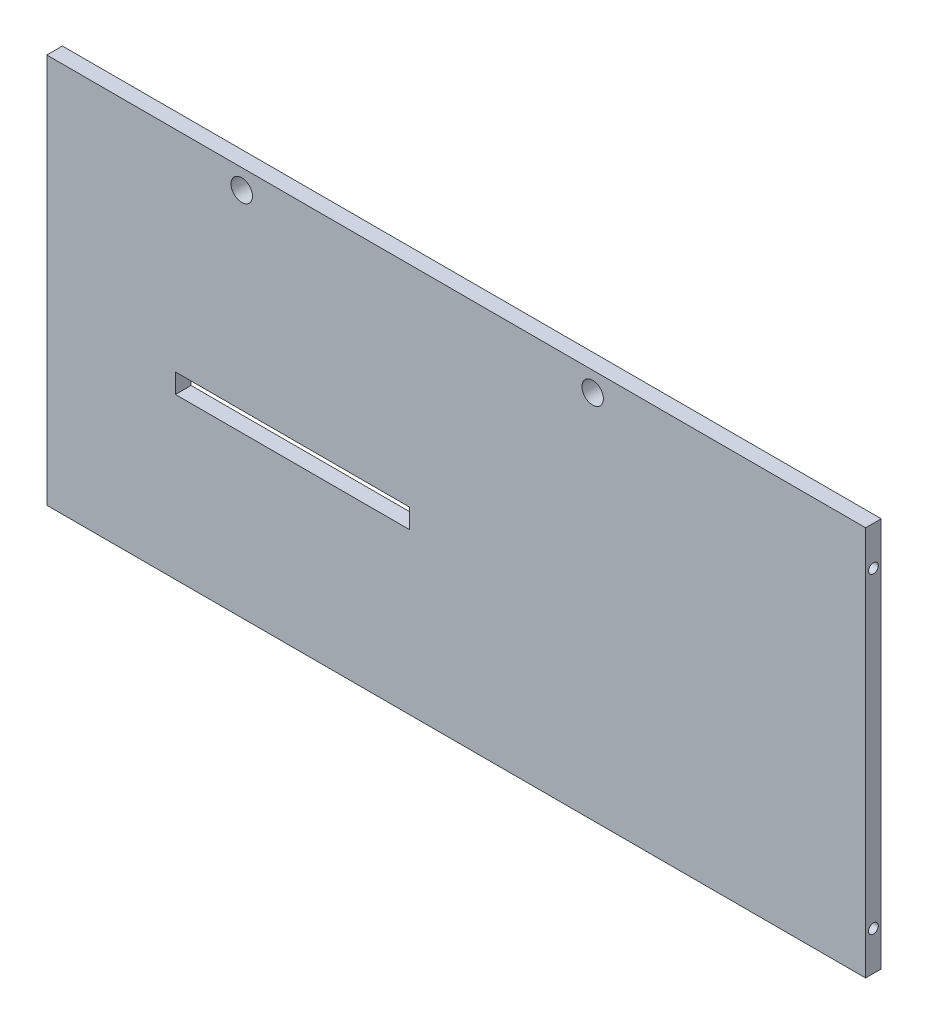
ISO-10303-21;
HEADER;
FILE_DESCRIPTION(('STEP AP214'),'2;1');
FILE_NAME('part.step','',(''),(''),'','','');
FILE_SCHEMA(('AUTOMOTIVE_DESIGN { 1 0 10303 214 1 1 1 1 }'));
ENDSEC;
DATA;
#1=APPLICATION_CONTEXT('core data for automotive mechanical design processes');
#2=APPLICATION_PROTOCOL_DEFINITION('international standard','automotive_design',2000,#1);
#3=PRODUCT_CONTEXT('',#1,'mechanical');
#4=PRODUCT('Part','Part','',(#3));
#5=PRODUCT_RELATED_PRODUCT_CATEGORY('part','',(#4));
#6=PRODUCT_DEFINITION_FORMATION('','',#4);
#7=PRODUCT_DEFINITION_CONTEXT('part definition',#1,'design');
#8=PRODUCT_DEFINITION('design','',#6,#7);
#9=PRODUCT_DEFINITION_SHAPE('','',#8);
#10=(LENGTH_UNIT() NAMED_UNIT(*) SI_UNIT(.MILLI.,.METRE.));
#11=(NAMED_UNIT(*) PLANE_ANGLE_UNIT() SI_UNIT($,.RADIAN.));
#12=(NAMED_UNIT(*) SI_UNIT($,.STERADIAN.) SOLID_ANGLE_UNIT());
#13=UNCERTAINTY_MEASURE_WITH_UNIT(LENGTH_MEASURE(1.E-05),#10,'distance_accuracy_value','');
#14=(GEOMETRIC_REPRESENTATION_CONTEXT(3) GLOBAL_UNCERTAINTY_ASSIGNED_CONTEXT((#13)) GLOBAL_UNIT_ASSIGNED_CONTEXT((#10,
#11,#12)) REPRESENTATION_CONTEXT('',''));
#15=CARTESIAN_POINT('',(0.,0.,0.));
#16=DIRECTION('',(0.,0.,1.));
#17=DIRECTION('',(1.,0.,0.));
#18=AXIS2_PLACEMENT_3D('',#15,#16,#17);
#19=CARTESIAN_POINT('',(0.,0.,4.));
#20=DIRECTION('',(1.,0.,0.));
#21=DIRECTION('',(0.,0.,-1.));
#22=AXIS2_PLACEMENT_3D('',#19,#20,#21);
#23=PLANE('',#22);
#24=CARTESIAN_POINT('',(0.,10.,1.99999999999999));
#25=DIRECTION('',(-1.,0.,0.));
#26=DIRECTION('',(0.,0.,1.));
#27=AXIS2_PLACEMENT_3D('',#24,#25,#26);
#28=CIRCLE('',#27,1.25);
#29=CARTESIAN_POINT('',(0.,10.,3.24999999999999));
#30=VERTEX_POINT('',#29);
#31=EDGE_CURVE('E153',#30,#30,#28,.T.);
#32=ORIENTED_EDGE('',*,*,#31,.F.);
#33=EDGE_LOOP('',(#32));
#34=FACE_BOUND('',#33,.T.);
#35=CARTESIAN_POINT('',(0.,90.,1.99999999999999));
#36=DIRECTION('',(-1.,0.,0.));
#37=DIRECTION('',(0.,0.,1.));
#38=AXIS2_PLACEMENT_3D('',#35,#36,#37);
#39=CIRCLE('',#38,1.25);
#40=CARTESIAN_POINT('',(0.,90.,3.24999999999999));
#41=VERTEX_POINT('',#40);
#42=EDGE_CURVE('E159',#41,#41,#39,.T.);
#43=ORIENTED_EDGE('',*,*,#42,.F.);
#44=EDGE_LOOP('',(#43));
#45=FACE_BOUND('',#44,.T.);
#46=DIRECTION('',(0.,-1.,0.));
#47=VECTOR('',#46,1.);
#48=CARTESIAN_POINT('',(0.,0.,0.));
#49=LINE('',#48,#47);
#50=CARTESIAN_POINT('',(0.,100.,0.));
#51=VERTEX_POINT('',#50);
#52=CARTESIAN_POINT('',(0.,0.,0.));
#53=VERTEX_POINT('',#52);
#54=EDGE_CURVE('E215',#51,#53,#49,.T.);
#55=ORIENTED_EDGE('',*,*,#54,.T.);
#56=DIRECTION('',(0.,0.,-1.));
#57=VECTOR('',#56,1.);
#58=CARTESIAN_POINT('',(0.,0.,4.));
#59=LINE('',#58,#57);
#60=CARTESIAN_POINT('',(0.,0.,4.));
#61=VERTEX_POINT('',#60);
#62=EDGE_CURVE('E11',#61,#53,#59,.T.);
#63=ORIENTED_EDGE('',*,*,#62,.F.);
#64=DIRECTION('',(0.,-1.,0.));
#65=VECTOR('',#64,1.);
#66=CARTESIAN_POINT('',(0.,0.,4.));
#67=LINE('',#66,#65);
#68=CARTESIAN_POINT('',(0.,100.,4.));
#69=VERTEX_POINT('',#68);
#70=EDGE_CURVE('E218',#69,#61,#67,.T.);
#71=ORIENTED_EDGE('',*,*,#70,.F.);
#72=DIRECTION('',(0.,0.,-1.));
#73=VECTOR('',#72,1.);
#74=CARTESIAN_POINT('',(0.,100.,4.));
#75=LINE('',#74,#73);
#76=EDGE_CURVE('E46',#69,#51,#75,.T.);
#77=ORIENTED_EDGE('',*,*,#76,.T.);
#78=EDGE_LOOP('',(#55,#63,#71,#77));
#79=FACE_BOUND('',#78,.T.);
#80=ADVANCED_FACE('F39',(#34,#45,#79),#23,.F.);
#81=CARTESIAN_POINT('',(0.,0.,4.));
#82=DIRECTION('',(0.,1.,0.));
#83=DIRECTION('',(0.,0.,1.));
#84=AXIS2_PLACEMENT_3D('',#81,#82,#83);
#85=PLANE('',#84);
#86=CARTESIAN_POINT('',(20.,0.,1.99999999999984));
#87=DIRECTION('',(0.,-1.,0.));
#88=DIRECTION('',(0.,0.,-1.));
#89=AXIS2_PLACEMENT_3D('',#86,#87,#88);
#90=CIRCLE('',#89,1.24999999999999);
#91=CARTESIAN_POINT('',(20.,0.,0.749999999999851));
#92=VERTEX_POINT('',#91);
#93=EDGE_CURVE('E131',#92,#92,#90,.T.);
#94=ORIENTED_EDGE('',*,*,#93,.F.);
#95=EDGE_LOOP('',(#94));
#96=FACE_BOUND('',#95,.T.);
#97=CARTESIAN_POINT('',(190.,0.,1.99999999999993));
#98=DIRECTION('',(0.,-1.,0.));
#99=DIRECTION('',(0.,0.,-1.));
#100=AXIS2_PLACEMENT_3D('',#97,#98,#99);
#101=CIRCLE('',#100,1.25);
#102=CARTESIAN_POINT('',(190.,0.,0.749999999999932));
#103=VERTEX_POINT('',#102);
#104=EDGE_CURVE('E130',#103,#103,#101,.T.);
#105=ORIENTED_EDGE('',*,*,#104,.F.);
#106=EDGE_LOOP('',(#105));
#107=FACE_BOUND('',#106,.T.);
#108=DIRECTION('',(1.,0.,0.));
#109=VECTOR('',#108,1.);
#110=CARTESIAN_POINT('',(0.,0.,0.));
#111=LINE('',#110,#109);
#112=CARTESIAN_POINT('',(210.,0.,0.));
#113=VERTEX_POINT('',#112);
#114=EDGE_CURVE('E228',#53,#113,#111,.T.);
#115=ORIENTED_EDGE('',*,*,#114,.T.);
#116=DIRECTION('',(0.,0.,-1.));
#117=VECTOR('',#116,1.);
#118=CARTESIAN_POINT('',(210.,0.,0.));
#119=LINE('',#118,#117);
#120=CARTESIAN_POINT('',(210.,0.,4.));
#121=VERTEX_POINT('',#120);
#122=EDGE_CURVE('E202',#121,#113,#119,.T.);
#123=ORIENTED_EDGE('',*,*,#122,.F.);
#124=DIRECTION('',(1.,0.,0.));
#125=VECTOR('',#124,1.);
#126=CARTESIAN_POINT('',(0.,0.,4.));
#127=LINE('',#126,#125);
#128=EDGE_CURVE('E221',#61,#121,#127,.T.);
#129=ORIENTED_EDGE('',*,*,#128,.F.);
#130=ORIENTED_EDGE('',*,*,#62,.T.);
#131=EDGE_LOOP('',(#115,#123,#129,#130));
#132=FACE_BOUND('',#131,.T.);
#133=ADVANCED_FACE('F243',(#96,#107,#132),#85,.F.);
#134=CARTESIAN_POINT('',(0.,100.,4.));
#135=DIRECTION('',(0.,-1.,0.));
#136=DIRECTION('',(0.,0.,-1.));
#137=AXIS2_PLACEMENT_3D('',#134,#135,#136);
#138=PLANE('',#137);
#139=DIRECTION('',(-1.,0.,0.));
#140=VECTOR('',#139,1.);
#141=CARTESIAN_POINT('',(0.,100.,0.));
#142=LINE('',#141,#140);
#143=CARTESIAN_POINT('',(210.,100.,0.));
#144=VERTEX_POINT('',#143);
#145=EDGE_CURVE('E222',#144,#51,#142,.T.);
#146=ORIENTED_EDGE('',*,*,#145,.T.);
#147=ORIENTED_EDGE('',*,*,#76,.F.);
#148=DIRECTION('',(-1.,0.,0.));
#149=VECTOR('',#148,1.);
#150=CARTESIAN_POINT('',(0.,100.,4.));
#151=LINE('',#150,#149);
#152=CARTESIAN_POINT('',(210.,100.,4.));
#153=VERTEX_POINT('',#152);
#154=EDGE_CURVE('E224',#153,#69,#151,.T.);
#155=ORIENTED_EDGE('',*,*,#154,.F.);
#156=DIRECTION('',(0.,0.,1.));
#157=VECTOR('',#156,1.);
#158=CARTESIAN_POINT('',(210.,100.,0.));
#159=LINE('',#158,#157);
#160=EDGE_CURVE('E196',#144,#153,#159,.T.);
#161=ORIENTED_EDGE('',*,*,#160,.F.);
#162=EDGE_LOOP('',(#146,#147,#155,#161));
#163=FACE_BOUND('',#162,.T.);
#164=ADVANCED_FACE('F247',(#163),#138,.F.);
#165=CARTESIAN_POINT('',(0.,0.,4.));
#166=DIRECTION('',(0.,0.,-1.));
#167=DIRECTION('',(-1.,0.,0.));
#168=AXIS2_PLACEMENT_3D('',#165,#166,#167);
#169=PLANE('',#168);
#170=DIRECTION('',(-1.,0.,0.));
#171=VECTOR('',#170,1.);
#172=CARTESIAN_POINT('',(0.,41.1,4.));
#173=LINE('',#172,#171);
#174=CARTESIAN_POINT('',(93.,41.1,4.));
#175=VERTEX_POINT('',#174);
#176=CARTESIAN_POINT('',(33.,41.1,4.));
#177=VERTEX_POINT('',#176);
#178=EDGE_CURVE('E187',#175,#177,#173,.T.);
#179=ORIENTED_EDGE('',*,*,#178,.T.);
#180=DIRECTION('',(0.,1.,0.));
#181=VECTOR('',#180,1.);
#182=CARTESIAN_POINT('',(33.0000000000001,0.,4.));
#183=LINE('',#182,#181);
#184=CARTESIAN_POINT('',(33.,46.1,4.));
#185=VERTEX_POINT('',#184);
#186=EDGE_CURVE('E190',#177,#185,#183,.T.);
#187=ORIENTED_EDGE('',*,*,#186,.T.);
#188=DIRECTION('',(1.,0.,0.));
#189=VECTOR('',#188,1.);
#190=CARTESIAN_POINT('',(0.,46.1,4.));
#191=LINE('',#190,#189);
#192=CARTESIAN_POINT('',(93.,46.1,4.));
#193=VERTEX_POINT('',#192);
#194=EDGE_CURVE('E177',#185,#193,#191,.T.);
#195=ORIENTED_EDGE('',*,*,#194,.T.);
#196=DIRECTION('',(0.,-1.,0.));
#197=VECTOR('',#196,1.);
#198=CARTESIAN_POINT('',(93.,0.,4.));
#199=LINE('',#198,#197);
#200=EDGE_CURVE('E184',#193,#175,#199,.T.);
#201=ORIENTED_EDGE('',*,*,#200,.T.);
#202=EDGE_LOOP('',(#179,#187,#195,#201));
#203=FACE_BOUND('',#202,.T.);
#204=CARTESIAN_POINT('',(140.,95.,4.));
#205=DIRECTION('',(0.,0.,-1.));
#206=DIRECTION('',(-1.,0.,0.));
#207=AXIS2_PLACEMENT_3D('',#204,#205,#206);
#208=CIRCLE('',#207,2.75000000000001);
#209=CARTESIAN_POINT('',(137.25,95.,4.));
#210=VERTEX_POINT('',#209);
#211=EDGE_CURVE('E206',#210,#210,#208,.T.);
#212=ORIENTED_EDGE('',*,*,#211,.T.);
#213=EDGE_LOOP('',(#212));
#214=FACE_BOUND('',#213,.T.);
#215=CARTESIAN_POINT('',(50.,95.,4.));
#216=DIRECTION('',(0.,0.,-1.));
#217=DIRECTION('',(-1.,0.,0.));
#218=AXIS2_PLACEMENT_3D('',#215,#216,#217);
#219=CIRCLE('',#218,2.75);
#220=CARTESIAN_POINT('',(47.25,95.,4.));
#221=VERTEX_POINT('',#220);
#222=EDGE_CURVE('E212',#221,#221,#219,.T.);
#223=ORIENTED_EDGE('',*,*,#222,.T.);
#224=EDGE_LOOP('',(#223));
#225=FACE_BOUND('',#224,.T.);
#226=ORIENTED_EDGE('',*,*,#70,.T.);
#227=ORIENTED_EDGE('',*,*,#128,.T.);
#228=DIRECTION('',(0.,-1.,0.));
#229=VECTOR('',#228,1.);
#230=CARTESIAN_POINT('',(210.,0.,4.));
#231=LINE('',#230,#229);
#232=EDGE_CURVE('E199',#153,#121,#231,.T.);
#233=ORIENTED_EDGE('',*,*,#232,.F.);
#234=ORIENTED_EDGE('',*,*,#154,.T.);
#235=EDGE_LOOP('',(#226,#227,#233,#234));
#236=FACE_BOUND('',#235,.T.);
#237=ADVANCED_FACE('F246',(#203,#214,#225,#236),#169,.F.);
#238=CARTESIAN_POINT('',(0.,0.,0.));
#239=DIRECTION('',(0.,0.,-1.));
#240=DIRECTION('',(-1.,0.,0.));
#241=AXIS2_PLACEMENT_3D('',#238,#239,#240);
#242=PLANE('',#241);
#243=DIRECTION('',(0.,1.,0.));
#244=VECTOR('',#243,1.);
#245=CARTESIAN_POINT('',(33.,41.1,0.));
#246=LINE('',#245,#244);
#247=CARTESIAN_POINT('',(33.,41.1,0.));
#248=VERTEX_POINT('',#247);
#249=CARTESIAN_POINT('',(33.,46.1,0.));
#250=VERTEX_POINT('',#249);
#251=EDGE_CURVE('E61',#248,#250,#246,.T.);
#252=ORIENTED_EDGE('',*,*,#251,.F.);
#253=DIRECTION('',(-1.,0.,0.));
#254=VECTOR('',#253,1.);
#255=CARTESIAN_POINT('',(33.,41.1,0.));
#256=LINE('',#255,#254);
#257=CARTESIAN_POINT('',(93.,41.1,0.));
#258=VERTEX_POINT('',#257);
#259=EDGE_CURVE('E171',#258,#248,#256,.T.);
#260=ORIENTED_EDGE('',*,*,#259,.F.);
#261=DIRECTION('',(0.,-1.,0.));
#262=VECTOR('',#261,1.);
#263=CARTESIAN_POINT('',(93.,41.1,0.));
#264=LINE('',#263,#262);
#265=CARTESIAN_POINT('',(93.,46.1,0.));
#266=VERTEX_POINT('',#265);
#267=EDGE_CURVE('E168',#266,#258,#264,.T.);
#268=ORIENTED_EDGE('',*,*,#267,.F.);
#269=DIRECTION('',(1.,0.,0.));
#270=VECTOR('',#269,1.);
#271=CARTESIAN_POINT('',(33.,46.1,0.));
#272=LINE('',#271,#270);
#273=EDGE_CURVE('E166',#250,#266,#272,.T.);
#274=ORIENTED_EDGE('',*,*,#273,.F.);
#275=EDGE_LOOP('',(#252,#260,#268,#274));
#276=FACE_BOUND('',#275,.T.);
#277=CARTESIAN_POINT('',(140.,95.,0.));
#278=DIRECTION('',(0.,0.,-1.));
#279=DIRECTION('',(-1.,0.,0.));
#280=AXIS2_PLACEMENT_3D('',#277,#278,#279);
#281=CIRCLE('',#280,2.75000000000001);
#282=CARTESIAN_POINT('',(137.25,95.,0.));
#283=VERTEX_POINT('',#282);
#284=EDGE_CURVE('E205',#283,#283,#281,.T.);
#285=ORIENTED_EDGE('',*,*,#284,.F.);
#286=EDGE_LOOP('',(#285));
#287=FACE_BOUND('',#286,.T.);
#288=CARTESIAN_POINT('',(50.,95.,0.));
#289=DIRECTION('',(0.,0.,-1.));
#290=DIRECTION('',(-1.,0.,0.));
#291=AXIS2_PLACEMENT_3D('',#288,#289,#290);
#292=CIRCLE('',#291,2.75);
#293=CARTESIAN_POINT('',(47.25,95.,0.));
#294=VERTEX_POINT('',#293);
#295=EDGE_CURVE('E209',#294,#294,#292,.T.);
#296=ORIENTED_EDGE('',*,*,#295,.F.);
#297=EDGE_LOOP('',(#296));
#298=FACE_BOUND('',#297,.T.);
#299=ORIENTED_EDGE('',*,*,#54,.F.);
#300=ORIENTED_EDGE('',*,*,#145,.F.);
#301=DIRECTION('',(0.,1.,0.));
#302=VECTOR('',#301,1.);
#303=CARTESIAN_POINT('',(210.,0.,0.));
#304=LINE('',#303,#302);
#305=EDGE_CURVE('E193',#113,#144,#304,.T.);
#306=ORIENTED_EDGE('',*,*,#305,.F.);
#307=ORIENTED_EDGE('',*,*,#114,.F.);
#308=EDGE_LOOP('',(#299,#300,#306,#307));
#309=FACE_BOUND('',#308,.T.);
#310=ADVANCED_FACE('F238',(#276,#287,#298,#309),#242,.T.);
#311=CARTESIAN_POINT('',(50.,95.,4.));
#312=DIRECTION('',(0.,0.,-1.));
#313=DIRECTION('',(-1.,0.,0.));
#314=AXIS2_PLACEMENT_3D('',#311,#312,#313);
#315=CYLINDRICAL_SURFACE('',#314,2.75);
#316=ORIENTED_EDGE('',*,*,#222,.F.);
#317=EDGE_LOOP('',(#316));
#318=FACE_BOUND('',#317,.T.);
#319=ORIENTED_EDGE('',*,*,#295,.T.);
#320=EDGE_LOOP('',(#319));
#321=FACE_BOUND('',#320,.T.);
#322=ADVANCED_FACE('F261',(#318,#321),#315,.F.);
#323=CARTESIAN_POINT('',(140.,95.,4.));
#324=DIRECTION('',(0.,0.,-1.));
#325=DIRECTION('',(-1.,0.,0.));
#326=AXIS2_PLACEMENT_3D('',#323,#324,#325);
#327=CYLINDRICAL_SURFACE('',#326,2.75000000000001);
#328=ORIENTED_EDGE('',*,*,#211,.F.);
#329=EDGE_LOOP('',(#328));
#330=FACE_BOUND('',#329,.T.);
#331=ORIENTED_EDGE('',*,*,#284,.T.);
#332=EDGE_LOOP('',(#331));
#333=FACE_BOUND('',#332,.T.);
#334=ADVANCED_FACE('F252',(#330,#333),#327,.F.);
#335=CARTESIAN_POINT('',(210.,0.,0.));
#336=DIRECTION('',(1.,0.,0.));
#337=DIRECTION('',(0.,0.,-1.));
#338=AXIS2_PLACEMENT_3D('',#335,#336,#337);
#339=PLANE('',#338);
#340=CARTESIAN_POINT('',(210.,9.99999999999999,2.));
#341=DIRECTION('',(1.,0.,0.));
#342=DIRECTION('',(0.,0.,-1.));
#343=AXIS2_PLACEMENT_3D('',#340,#341,#342);
#344=CIRCLE('',#343,1.24999999999999);
#345=CARTESIAN_POINT('',(210.,9.99999999999999,0.750000000000013));
#346=VERTEX_POINT('',#345);
#347=EDGE_CURVE('E141',#346,#346,#344,.T.);
#348=ORIENTED_EDGE('',*,*,#347,.F.);
#349=EDGE_LOOP('',(#348));
#350=FACE_BOUND('',#349,.T.);
#351=CARTESIAN_POINT('',(210.,90.,2.00000000000001));
#352=DIRECTION('',(1.,0.,0.));
#353=DIRECTION('',(0.,0.,-1.));
#354=AXIS2_PLACEMENT_3D('',#351,#352,#353);
#355=CIRCLE('',#354,1.24999999999999);
#356=CARTESIAN_POINT('',(210.,90.,0.750000000000022));
#357=VERTEX_POINT('',#356);
#358=EDGE_CURVE('E147',#357,#357,#355,.T.);
#359=ORIENTED_EDGE('',*,*,#358,.F.);
#360=EDGE_LOOP('',(#359));
#361=FACE_BOUND('',#360,.T.);
#362=ORIENTED_EDGE('',*,*,#305,.T.);
#363=ORIENTED_EDGE('',*,*,#160,.T.);
#364=ORIENTED_EDGE('',*,*,#232,.T.);
#365=ORIENTED_EDGE('',*,*,#122,.T.);
#366=EDGE_LOOP('',(#362,#363,#364,#365));
#367=FACE_BOUND('',#366,.T.);
#368=ADVANCED_FACE('F249',(#350,#361,#367),#339,.T.);
#369=CARTESIAN_POINT('',(33.,41.1,5.));
#370=DIRECTION('',(-1.,0.,0.));
#371=DIRECTION('',(0.,-1.,0.));
#372=AXIS2_PLACEMENT_3D('',#369,#370,#371);
#373=PLANE('',#372);
#374=DIRECTION('',(0.,0.,-1.));
#375=VECTOR('',#374,1.);
#376=CARTESIAN_POINT('',(33.,41.1,5.));
#377=LINE('',#376,#375);
#378=EDGE_CURVE('E175',#177,#248,#377,.T.);
#379=ORIENTED_EDGE('',*,*,#378,.T.);
#380=ORIENTED_EDGE('',*,*,#251,.T.);
#381=DIRECTION('',(0.,0.,-1.));
#382=VECTOR('',#381,1.);
#383=CARTESIAN_POINT('',(33.,46.1,5.));
#384=LINE('',#383,#382);
#385=EDGE_CURVE('E174',#185,#250,#384,.T.);
#386=ORIENTED_EDGE('',*,*,#385,.F.);
#387=ORIENTED_EDGE('',*,*,#186,.F.);
#388=EDGE_LOOP('',(#379,#380,#386,#387));
#389=FACE_BOUND('',#388,.T.);
#390=ADVANCED_FACE('F251',(#389),#373,.F.);
#391=CARTESIAN_POINT('',(33.,41.1,5.));
#392=DIRECTION('',(0.,-1.,0.));
#393=DIRECTION('',(1.,0.,0.));
#394=AXIS2_PLACEMENT_3D('',#391,#392,#393);
#395=PLANE('',#394);
#396=DIRECTION('',(0.,0.,-1.));
#397=VECTOR('',#396,1.);
#398=CARTESIAN_POINT('',(93.,41.1,5.));
#399=LINE('',#398,#397);
#400=EDGE_CURVE('E178',#175,#258,#399,.T.);
#401=ORIENTED_EDGE('',*,*,#400,.T.);
#402=ORIENTED_EDGE('',*,*,#259,.T.);
#403=ORIENTED_EDGE('',*,*,#378,.F.);
#404=ORIENTED_EDGE('',*,*,#178,.F.);
#405=EDGE_LOOP('',(#401,#402,#403,#404));
#406=FACE_BOUND('',#405,.T.);
#407=ADVANCED_FACE('F259',(#406),#395,.F.);
#408=CARTESIAN_POINT('',(93.,41.1,5.));
#409=DIRECTION('',(1.,0.,0.));
#410=DIRECTION('',(0.,0.,-1.));
#411=AXIS2_PLACEMENT_3D('',#408,#409,#410);
#412=PLANE('',#411);
#413=DIRECTION('',(0.,0.,-1.));
#414=VECTOR('',#413,1.);
#415=CARTESIAN_POINT('',(93.,46.1,5.));
#416=LINE('',#415,#414);
#417=EDGE_CURVE('E53',#193,#266,#416,.T.);
#418=ORIENTED_EDGE('',*,*,#417,.T.);
#419=ORIENTED_EDGE('',*,*,#267,.T.);
#420=ORIENTED_EDGE('',*,*,#400,.F.);
#421=ORIENTED_EDGE('',*,*,#200,.F.);
#422=EDGE_LOOP('',(#418,#419,#420,#421));
#423=FACE_BOUND('',#422,.T.);
#424=ADVANCED_FACE('F297',(#423),#412,.F.);
#425=CARTESIAN_POINT('',(33.,46.1,5.));
#426=DIRECTION('',(0.,1.,0.));
#427=DIRECTION('',(-1.,0.,0.));
#428=AXIS2_PLACEMENT_3D('',#425,#426,#427);
#429=PLANE('',#428);
#430=ORIENTED_EDGE('',*,*,#385,.T.);
#431=ORIENTED_EDGE('',*,*,#273,.T.);
#432=ORIENTED_EDGE('',*,*,#417,.F.);
#433=ORIENTED_EDGE('',*,*,#194,.F.);
#434=EDGE_LOOP('',(#430,#431,#432,#433));
#435=FACE_BOUND('',#434,.T.);
#436=ADVANCED_FACE('F289',(#435),#429,.F.);
#437=CARTESIAN_POINT('',(7.5,90.,1.99999999999999));
#438=DIRECTION('',(-1.,0.,0.));
#439=DIRECTION('',(0.,0.,1.));
#440=AXIS2_PLACEMENT_3D('',#437,#438,#439);
#441=CONICAL_SURFACE('',#440,1.25,1.02974425867666);
#442=CARTESIAN_POINT('',(8.25107577378445,90.,1.99999999999999));
#443=VERTEX_POINT('',#442);
#444=VERTEX_LOOP('',#443);
#445=FACE_BOUND('',#444,.T.);
#446=CARTESIAN_POINT('',(7.5,90.,1.99999999999999));
#447=DIRECTION('',(-1.,0.,0.));
#448=DIRECTION('',(0.,0.,1.));
#449=AXIS2_PLACEMENT_3D('',#446,#447,#448);
#450=CIRCLE('',#449,1.25);
#451=CARTESIAN_POINT('',(7.5,90.,3.24999999999999));
#452=VERTEX_POINT('',#451);
#453=EDGE_CURVE('E162',#452,#452,#450,.T.);
#454=ORIENTED_EDGE('',*,*,#453,.T.);
#455=EDGE_LOOP('',(#454));
#456=FACE_BOUND('',#455,.T.);
#457=ADVANCED_FACE('F279',(#445,#456),#441,.F.);
#458=CARTESIAN_POINT('',(0.,90.,1.99999999999999));
#459=DIRECTION('',(-1.,0.,0.));
#460=DIRECTION('',(0.,0.,1.));
#461=AXIS2_PLACEMENT_3D('',#458,#459,#460);
#462=CYLINDRICAL_SURFACE('',#461,1.25);
#463=ORIENTED_EDGE('',*,*,#453,.F.);
#464=EDGE_LOOP('',(#463));
#465=FACE_BOUND('',#464,.T.);
#466=ORIENTED_EDGE('',*,*,#42,.T.);
#467=EDGE_LOOP('',(#466));
#468=FACE_BOUND('',#467,.T.);
#469=ADVANCED_FACE('F276',(#465,#468),#462,.F.);
#470=CARTESIAN_POINT('',(7.5,10.,1.99999999999999));
#471=DIRECTION('',(-1.,0.,0.));
#472=DIRECTION('',(0.,0.,1.));
#473=AXIS2_PLACEMENT_3D('',#470,#471,#472);
#474=CONICAL_SURFACE('',#473,1.25,1.02974425867665);
#475=CARTESIAN_POINT('',(8.25107577378445,10.,1.99999999999999));
#476=VERTEX_POINT('',#475);
#477=VERTEX_LOOP('',#476);
#478=FACE_BOUND('',#477,.T.);
#479=CARTESIAN_POINT('',(7.5,10.,1.99999999999999));
#480=DIRECTION('',(-1.,0.,0.));
#481=DIRECTION('',(0.,0.,1.));
#482=AXIS2_PLACEMENT_3D('',#479,#480,#481);
#483=CIRCLE('',#482,1.25);
#484=CARTESIAN_POINT('',(7.5,10.,3.24999999999999));
#485=VERTEX_POINT('',#484);
#486=EDGE_CURVE('E156',#485,#485,#483,.T.);
#487=ORIENTED_EDGE('',*,*,#486,.T.);
#488=EDGE_LOOP('',(#487));
#489=FACE_BOUND('',#488,.T.);
#490=ADVANCED_FACE('F278',(#478,#489),#474,.F.);
#491=CARTESIAN_POINT('',(0.,10.,1.99999999999999));
#492=DIRECTION('',(-1.,0.,0.));
#493=DIRECTION('',(0.,0.,1.));
#494=AXIS2_PLACEMENT_3D('',#491,#492,#493);
#495=CYLINDRICAL_SURFACE('',#494,1.25);
#496=ORIENTED_EDGE('',*,*,#486,.F.);
#497=EDGE_LOOP('',(#496));
#498=FACE_BOUND('',#497,.T.);
#499=ORIENTED_EDGE('',*,*,#31,.T.);
#500=EDGE_LOOP('',(#499));
#501=FACE_BOUND('',#500,.T.);
#502=ADVANCED_FACE('F286',(#498,#501),#495,.F.);
#503=CARTESIAN_POINT('',(202.5,90.,2.00000000000001));
#504=DIRECTION('',(1.,0.,0.));
#505=DIRECTION('',(0.,0.,-1.));
#506=AXIS2_PLACEMENT_3D('',#503,#504,#505);
#507=CONICAL_SURFACE('',#506,1.24999999999999,1.02974425867664);
#508=CARTESIAN_POINT('',(201.748924226216,90.,2.00000000000001));
#509=VERTEX_POINT('',#508);
#510=VERTEX_LOOP('',#509);
#511=FACE_BOUND('',#510,.T.);
#512=CARTESIAN_POINT('',(202.5,90.,2.00000000000001));
#513=DIRECTION('',(1.,0.,0.));
#514=DIRECTION('',(0.,0.,-1.));
#515=AXIS2_PLACEMENT_3D('',#512,#513,#514);
#516=CIRCLE('',#515,1.24999999999999);
#517=CARTESIAN_POINT('',(202.5,90.,0.750000000000022));
#518=VERTEX_POINT('',#517);
#519=EDGE_CURVE('E150',#518,#518,#516,.T.);
#520=ORIENTED_EDGE('',*,*,#519,.T.);
#521=EDGE_LOOP('',(#520));
#522=FACE_BOUND('',#521,.T.);
#523=ADVANCED_FACE('F403',(#511,#522),#507,.F.);
#524=CARTESIAN_POINT('',(210.,90.,2.00000000000001));
#525=DIRECTION('',(1.,0.,0.));
#526=DIRECTION('',(0.,0.,-1.));
#527=AXIS2_PLACEMENT_3D('',#524,#525,#526);
#528=CYLINDRICAL_SURFACE('',#527,1.24999999999999);
#529=ORIENTED_EDGE('',*,*,#519,.F.);
#530=EDGE_LOOP('',(#529));
#531=FACE_BOUND('',#530,.T.);
#532=ORIENTED_EDGE('',*,*,#358,.T.);
#533=EDGE_LOOP('',(#532));
#534=FACE_BOUND('',#533,.T.);
#535=ADVANCED_FACE('F417',(#531,#534),#528,.F.);
#536=CARTESIAN_POINT('',(202.5,9.99999999999999,2.));
#537=DIRECTION('',(1.,0.,0.));
#538=DIRECTION('',(0.,0.,-1.));
#539=AXIS2_PLACEMENT_3D('',#536,#537,#538);
#540=CONICAL_SURFACE('',#539,1.24999999999999,1.02974425867664);
#541=CARTESIAN_POINT('',(201.748924226216,9.99999999999998,2.));
#542=VERTEX_POINT('',#541);
#543=VERTEX_LOOP('',#542);
#544=FACE_BOUND('',#543,.T.);
#545=CARTESIAN_POINT('',(202.5,9.99999999999999,2.));
#546=DIRECTION('',(1.,0.,0.));
#547=DIRECTION('',(0.,0.,-1.));
#548=AXIS2_PLACEMENT_3D('',#545,#546,#547);
#549=CIRCLE('',#548,1.24999999999999);
#550=CARTESIAN_POINT('',(202.5,9.99999999999999,0.750000000000015));
#551=VERTEX_POINT('',#550);
#552=EDGE_CURVE('E144',#551,#551,#549,.T.);
#553=ORIENTED_EDGE('',*,*,#552,.T.);
#554=EDGE_LOOP('',(#553));
#555=FACE_BOUND('',#554,.T.);
#556=ADVANCED_FACE('F428',(#544,#555),#540,.F.);
#557=CARTESIAN_POINT('',(210.,9.99999999999999,2.));
#558=DIRECTION('',(1.,0.,0.));
#559=DIRECTION('',(0.,0.,-1.));
#560=AXIS2_PLACEMENT_3D('',#557,#558,#559);
#561=CYLINDRICAL_SURFACE('',#560,1.24999999999999);
#562=ORIENTED_EDGE('',*,*,#552,.F.);
#563=EDGE_LOOP('',(#562));
#564=FACE_BOUND('',#563,.T.);
#565=ORIENTED_EDGE('',*,*,#347,.T.);
#566=EDGE_LOOP('',(#565));
#567=FACE_BOUND('',#566,.T.);
#568=ADVANCED_FACE('F440',(#564,#567),#561,.F.);
#569=CARTESIAN_POINT('',(190.,7.49999999999999,1.99999999999993));
#570=DIRECTION('',(0.,-1.,0.));
#571=DIRECTION('',(0.,0.,-1.));
#572=AXIS2_PLACEMENT_3D('',#569,#570,#571);
#573=CONICAL_SURFACE('',#572,1.25,1.02974425867665);
#574=CARTESIAN_POINT('',(190.,8.25107577378445,1.99999999999993));
#575=VERTEX_POINT('',#574);
#576=VERTEX_LOOP('',#575);
#577=FACE_BOUND('',#576,.T.);
#578=CARTESIAN_POINT('',(190.,7.49999999999999,1.99999999999993));
#579=DIRECTION('',(0.,-1.,0.));
#580=DIRECTION('',(0.,0.,-1.));
#581=AXIS2_PLACEMENT_3D('',#578,#579,#580);
#582=CIRCLE('',#581,1.25);
#583=CARTESIAN_POINT('',(190.,7.49999999999999,0.749999999999932));
#584=VERTEX_POINT('',#583);
#585=EDGE_CURVE('E134',#584,#584,#582,.T.);
#586=ORIENTED_EDGE('',*,*,#585,.T.);
#587=EDGE_LOOP('',(#586));
#588=FACE_BOUND('',#587,.T.);
#589=ADVANCED_FACE('F449',(#577,#588),#573,.F.);
#590=CARTESIAN_POINT('',(190.,0.,1.99999999999993));
#591=DIRECTION('',(0.,-1.,0.));
#592=DIRECTION('',(0.,0.,-1.));
#593=AXIS2_PLACEMENT_3D('',#590,#591,#592);
#594=CYLINDRICAL_SURFACE('',#593,1.25);
#595=ORIENTED_EDGE('',*,*,#585,.F.);
#596=EDGE_LOOP('',(#595));
#597=FACE_BOUND('',#596,.T.);
#598=ORIENTED_EDGE('',*,*,#104,.T.);
#599=EDGE_LOOP('',(#598));
#600=FACE_BOUND('',#599,.T.);
#601=ADVANCED_FACE('F124',(#597,#600),#594,.F.);
#602=CARTESIAN_POINT('',(20.,7.49999999999999,1.99999999999984));
#603=DIRECTION('',(0.,-1.,0.));
#604=DIRECTION('',(0.,0.,-1.));
#605=AXIS2_PLACEMENT_3D('',#602,#603,#604);
#606=CONICAL_SURFACE('',#605,1.24999999999999,1.02974425867664);
#607=CARTESIAN_POINT('',(20.,8.25107577378445,1.99999999999984));
#608=VERTEX_POINT('',#607);
#609=VERTEX_LOOP('',#608);
#610=FACE_BOUND('',#609,.T.);
#611=CARTESIAN_POINT('',(20.,7.49999999999999,1.99999999999984));
#612=DIRECTION('',(0.,-1.,0.));
#613=DIRECTION('',(0.,0.,-1.));
#614=AXIS2_PLACEMENT_3D('',#611,#612,#613);
#615=CIRCLE('',#614,1.24999999999999);
#616=CARTESIAN_POINT('',(20.,7.49999999999999,0.749999999999851));
#617=VERTEX_POINT('',#616);
#618=EDGE_CURVE('E128',#617,#617,#615,.T.);
#619=ORIENTED_EDGE('',*,*,#618,.T.);
#620=EDGE_LOOP('',(#619));
#621=FACE_BOUND('',#620,.T.);
#622=ADVANCED_FACE('F120',(#610,#621),#606,.F.);
#623=CARTESIAN_POINT('',(20.,0.,1.99999999999984));
#624=DIRECTION('',(0.,-1.,0.));
#625=DIRECTION('',(0.,0.,-1.));
#626=AXIS2_PLACEMENT_3D('',#623,#624,#625);
#627=CYLINDRICAL_SURFACE('',#626,1.24999999999999);
#628=ORIENTED_EDGE('',*,*,#618,.F.);
#629=EDGE_LOOP('',(#628));
#630=FACE_BOUND('',#629,.T.);
#631=ORIENTED_EDGE('',*,*,#93,.T.);
#632=EDGE_LOOP('',(#631));
#633=FACE_BOUND('',#632,.T.);
#634=ADVANCED_FACE('F123',(#630,#633),#627,.F.);
#635=CLOSED_SHELL('',(#80,#133,#164,#237,#310,#322,#334,#368,#390,#407,#424,#436,#457,#469,#490,
#502,#523,#535,#556,#568,#589,#601,#622,#634));
#636=MANIFOLD_SOLID_BREP('B2',#635);
#637=ADVANCED_BREP_SHAPE_REPRESENTATION('',(#18,#636),#14);
#638=SHAPE_DEFINITION_REPRESENTATION(#9,#637);
ENDSEC;
END-ISO-10303-21;
